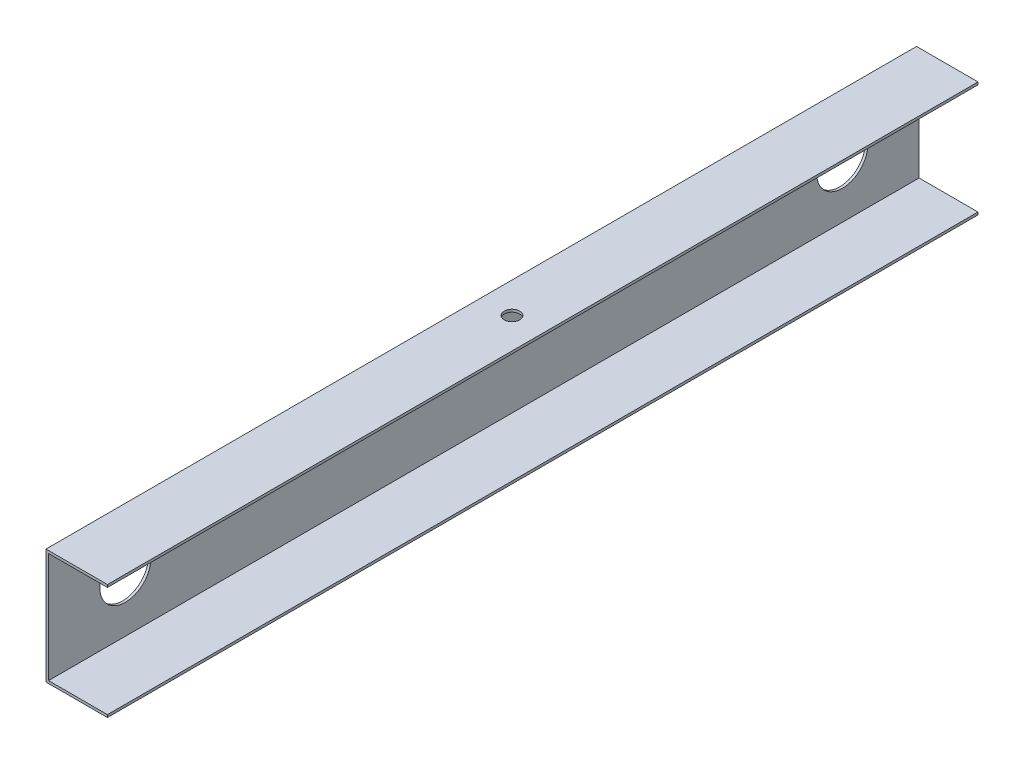
ISO-10303-21;
HEADER;
FILE_DESCRIPTION(('STEP AP214'),'2;1');
FILE_NAME('part.step','',(''),(''),'','','');
FILE_SCHEMA(('AUTOMOTIVE_DESIGN { 1 0 10303 214 1 1 1 1 }'));
ENDSEC;
DATA;
#1=APPLICATION_CONTEXT('core data for automotive mechanical design processes');
#2=APPLICATION_PROTOCOL_DEFINITION('international standard','automotive_design',2000,#1);
#3=PRODUCT_CONTEXT('',#1,'mechanical');
#4=PRODUCT('Part','Part','',(#3));
#5=PRODUCT_RELATED_PRODUCT_CATEGORY('part','',(#4));
#6=PRODUCT_DEFINITION_FORMATION('','',#4);
#7=PRODUCT_DEFINITION_CONTEXT('part definition',#1,'design');
#8=PRODUCT_DEFINITION('design','',#6,#7);
#9=PRODUCT_DEFINITION_SHAPE('','',#8);
#10=(LENGTH_UNIT() NAMED_UNIT(*) SI_UNIT(.MILLI.,.METRE.));
#11=(NAMED_UNIT(*) PLANE_ANGLE_UNIT() SI_UNIT($,.RADIAN.));
#12=(NAMED_UNIT(*) SI_UNIT($,.STERADIAN.) SOLID_ANGLE_UNIT());
#13=UNCERTAINTY_MEASURE_WITH_UNIT(LENGTH_MEASURE(1.E-05),#10,'distance_accuracy_value','');
#14=(GEOMETRIC_REPRESENTATION_CONTEXT(3) GLOBAL_UNCERTAINTY_ASSIGNED_CONTEXT((#13)) GLOBAL_UNIT_ASSIGNED_CONTEXT((#10,
#11,#12)) REPRESENTATION_CONTEXT('',''));
#15=CARTESIAN_POINT('',(0.,0.,0.));
#16=DIRECTION('',(0.,0.,1.));
#17=DIRECTION('',(1.,0.,0.));
#18=AXIS2_PLACEMENT_3D('',#15,#16,#17);
#19=CARTESIAN_POINT('',(0.,0.,340.));
#20=DIRECTION('',(1.,0.,0.));
#21=DIRECTION('',(0.,1.,0.));
#22=AXIS2_PLACEMENT_3D('',#19,#20,#21);
#23=PLANE('',#22);
#24=CARTESIAN_POINT('',(0.,-22.5,30.));
#25=DIRECTION('',(-1.,0.,0.));
#26=DIRECTION('',(0.,-1.,0.));
#27=AXIS2_PLACEMENT_3D('',#24,#25,#26);
#28=CIRCLE('',#27,10.);
#29=CARTESIAN_POINT('',(0.,-32.5,30.));
#30=VERTEX_POINT('',#29);
#31=EDGE_CURVE('E161',#30,#30,#28,.T.);
#32=ORIENTED_EDGE('',*,*,#31,.F.);
#33=EDGE_LOOP('',(#32));
#34=FACE_BOUND('',#33,.T.);
#35=CARTESIAN_POINT('',(0.,-22.5,310.));
#36=DIRECTION('',(-1.,0.,0.));
#37=DIRECTION('',(0.,1.,0.));
#38=AXIS2_PLACEMENT_3D('',#35,#36,#37);
#39=CIRCLE('',#38,10.);
#40=CARTESIAN_POINT('',(0.,-12.5,310.));
#41=VERTEX_POINT('',#40);
#42=EDGE_CURVE('E166',#41,#41,#39,.T.);
#43=ORIENTED_EDGE('',*,*,#42,.F.);
#44=EDGE_LOOP('',(#43));
#45=FACE_BOUND('',#44,.T.);
#46=DIRECTION('',(0.,-1.,0.));
#47=VECTOR('',#46,1.);
#48=CARTESIAN_POINT('',(0.,0.,0.));
#49=LINE('',#48,#47);
#50=CARTESIAN_POINT('',(0.,0.,0.));
#51=VERTEX_POINT('',#50);
#52=CARTESIAN_POINT('',(0.,-45.,0.));
#53=VERTEX_POINT('',#52);
#54=EDGE_CURVE('E134',#51,#53,#49,.T.);
#55=ORIENTED_EDGE('',*,*,#54,.T.);
#56=DIRECTION('',(0.,0.,-1.));
#57=VECTOR('',#56,1.);
#58=CARTESIAN_POINT('',(0.,-45.,340.));
#59=LINE('',#58,#57);
#60=CARTESIAN_POINT('',(0.,-45.,340.));
#61=VERTEX_POINT('',#60);
#62=EDGE_CURVE('E11',#61,#53,#59,.T.);
#63=ORIENTED_EDGE('',*,*,#62,.F.);
#64=DIRECTION('',(0.,-1.,0.));
#65=VECTOR('',#64,1.);
#66=CARTESIAN_POINT('',(0.,0.,340.));
#67=LINE('',#66,#65);
#68=CARTESIAN_POINT('',(0.,0.,340.));
#69=VERTEX_POINT('',#68);
#70=EDGE_CURVE('E148',#69,#61,#67,.T.);
#71=ORIENTED_EDGE('',*,*,#70,.F.);
#72=DIRECTION('',(0.,0.,-1.));
#73=VECTOR('',#72,1.);
#74=CARTESIAN_POINT('',(0.,0.,340.));
#75=LINE('',#74,#73);
#76=EDGE_CURVE('E130',#69,#51,#75,.T.);
#77=ORIENTED_EDGE('',*,*,#76,.T.);
#78=EDGE_LOOP('',(#55,#63,#71,#77));
#79=FACE_BOUND('',#78,.T.);
#80=ADVANCED_FACE('F36',(#34,#45,#79),#23,.F.);
#81=CARTESIAN_POINT('',(0.,-45.,340.));
#82=DIRECTION('',(0.,1.,0.));
#83=DIRECTION('',(0.,0.,1.));
#84=AXIS2_PLACEMENT_3D('',#81,#82,#83);
#85=PLANE('',#84);
#86=DIRECTION('',(1.,0.,0.));
#87=VECTOR('',#86,1.);
#88=CARTESIAN_POINT('',(0.,-45.,0.));
#89=LINE('',#88,#87);
#90=CARTESIAN_POINT('',(24.,-45.,0.));
#91=VERTEX_POINT('',#90);
#92=EDGE_CURVE('E137',#53,#91,#89,.T.);
#93=ORIENTED_EDGE('',*,*,#92,.T.);
#94=DIRECTION('',(0.,0.,-1.));
#95=VECTOR('',#94,1.);
#96=CARTESIAN_POINT('',(24.,-45.,340.));
#97=LINE('',#96,#95);
#98=CARTESIAN_POINT('',(24.,-45.,340.));
#99=VERTEX_POINT('',#98);
#100=EDGE_CURVE('E45',#99,#91,#97,.T.);
#101=ORIENTED_EDGE('',*,*,#100,.F.);
#102=DIRECTION('',(1.,0.,0.));
#103=VECTOR('',#102,1.);
#104=CARTESIAN_POINT('',(0.,-45.,340.));
#105=LINE('',#104,#103);
#106=EDGE_CURVE('E97',#61,#99,#105,.T.);
#107=ORIENTED_EDGE('',*,*,#106,.F.);
#108=ORIENTED_EDGE('',*,*,#62,.T.);
#109=EDGE_LOOP('',(#93,#101,#107,#108));
#110=FACE_BOUND('',#109,.T.);
#111=ADVANCED_FACE('F211',(#110),#85,.F.);
#112=CARTESIAN_POINT('',(24.,-44.,340.));
#113=DIRECTION('',(-1.,0.,0.));
#114=DIRECTION('',(0.,0.,1.));
#115=AXIS2_PLACEMENT_3D('',#112,#113,#114);
#116=PLANE('',#115);
#117=DIRECTION('',(0.,1.,0.));
#118=VECTOR('',#117,1.);
#119=CARTESIAN_POINT('',(24.,-44.,0.));
#120=LINE('',#119,#118);
#121=CARTESIAN_POINT('',(24.,-44.,0.));
#122=VERTEX_POINT('',#121);
#123=EDGE_CURVE('E139',#91,#122,#120,.T.);
#124=ORIENTED_EDGE('',*,*,#123,.T.);
#125=DIRECTION('',(0.,0.,-1.));
#126=VECTOR('',#125,1.);
#127=CARTESIAN_POINT('',(24.,-44.,340.));
#128=LINE('',#127,#126);
#129=CARTESIAN_POINT('',(24.,-44.,340.));
#130=VERTEX_POINT('',#129);
#131=EDGE_CURVE('E155',#130,#122,#128,.T.);
#132=ORIENTED_EDGE('',*,*,#131,.F.);
#133=DIRECTION('',(0.,1.,0.));
#134=VECTOR('',#133,1.);
#135=CARTESIAN_POINT('',(24.,-44.,340.));
#136=LINE('',#135,#134);
#137=EDGE_CURVE('E178',#99,#130,#136,.T.);
#138=ORIENTED_EDGE('',*,*,#137,.F.);
#139=ORIENTED_EDGE('',*,*,#100,.T.);
#140=EDGE_LOOP('',(#124,#132,#138,#139));
#141=FACE_BOUND('',#140,.T.);
#142=ADVANCED_FACE('F216',(#141),#116,.F.);
#143=CARTESIAN_POINT('',(1.,-44.,340.));
#144=DIRECTION('',(0.,-1.,0.));
#145=DIRECTION('',(0.,0.,-1.));
#146=AXIS2_PLACEMENT_3D('',#143,#144,#145);
#147=PLANE('',#146);
#148=DIRECTION('',(-1.,0.,0.));
#149=VECTOR('',#148,1.);
#150=CARTESIAN_POINT('',(1.,-44.,0.));
#151=LINE('',#150,#149);
#152=CARTESIAN_POINT('',(1.,-44.,0.));
#153=VERTEX_POINT('',#152);
#154=EDGE_CURVE('E141',#122,#153,#151,.T.);
#155=ORIENTED_EDGE('',*,*,#154,.T.);
#156=DIRECTION('',(0.,0.,-1.));
#157=VECTOR('',#156,1.);
#158=CARTESIAN_POINT('',(1.,-44.,340.));
#159=LINE('',#158,#157);
#160=CARTESIAN_POINT('',(1.,-44.,340.));
#161=VERTEX_POINT('',#160);
#162=EDGE_CURVE('E152',#161,#153,#159,.T.);
#163=ORIENTED_EDGE('',*,*,#162,.F.);
#164=DIRECTION('',(-1.,0.,0.));
#165=VECTOR('',#164,1.);
#166=CARTESIAN_POINT('',(1.,-44.,340.));
#167=LINE('',#166,#165);
#168=EDGE_CURVE('E180',#130,#161,#167,.T.);
#169=ORIENTED_EDGE('',*,*,#168,.F.);
#170=ORIENTED_EDGE('',*,*,#131,.T.);
#171=EDGE_LOOP('',(#155,#163,#169,#170));
#172=FACE_BOUND('',#171,.T.);
#173=ADVANCED_FACE('F186',(#172),#147,.F.);
#174=CARTESIAN_POINT('',(1.,-1.,340.));
#175=DIRECTION('',(-1.,0.,0.));
#176=DIRECTION('',(0.,0.,1.));
#177=AXIS2_PLACEMENT_3D('',#174,#175,#176);
#178=PLANE('',#177);
#179=CARTESIAN_POINT('',(1.,-22.5,30.));
#180=DIRECTION('',(-1.,0.,0.));
#181=DIRECTION('',(0.,0.,1.));
#182=AXIS2_PLACEMENT_3D('',#179,#180,#181);
#183=CIRCLE('',#182,10.);
#184=CARTESIAN_POINT('',(1.,-22.5,40.));
#185=VERTEX_POINT('',#184);
#186=EDGE_CURVE('E39',#185,#185,#183,.T.);
#187=ORIENTED_EDGE('',*,*,#186,.T.);
#188=EDGE_LOOP('',(#187));
#189=FACE_BOUND('',#188,.T.);
#190=CARTESIAN_POINT('',(1.,-22.5,310.));
#191=DIRECTION('',(-1.,0.,0.));
#192=DIRECTION('',(0.,0.,1.));
#193=AXIS2_PLACEMENT_3D('',#190,#191,#192);
#194=CIRCLE('',#193,10.);
#195=CARTESIAN_POINT('',(1.,-22.5,320.));
#196=VERTEX_POINT('',#195);
#197=EDGE_CURVE('E159',#196,#196,#194,.T.);
#198=ORIENTED_EDGE('',*,*,#197,.T.);
#199=EDGE_LOOP('',(#198));
#200=FACE_BOUND('',#199,.T.);
#201=DIRECTION('',(0.,1.,0.));
#202=VECTOR('',#201,1.);
#203=CARTESIAN_POINT('',(1.,-1.,0.));
#204=LINE('',#203,#202);
#205=CARTESIAN_POINT('',(1.,-1.,0.));
#206=VERTEX_POINT('',#205);
#207=EDGE_CURVE('E143',#153,#206,#204,.T.);
#208=ORIENTED_EDGE('',*,*,#207,.T.);
#209=DIRECTION('',(0.,0.,-1.));
#210=VECTOR('',#209,1.);
#211=CARTESIAN_POINT('',(1.,-1.,340.));
#212=LINE('',#211,#210);
#213=CARTESIAN_POINT('',(1.,-1.,340.));
#214=VERTEX_POINT('',#213);
#215=EDGE_CURVE('E125',#214,#206,#212,.T.);
#216=ORIENTED_EDGE('',*,*,#215,.F.);
#217=DIRECTION('',(0.,1.,0.));
#218=VECTOR('',#217,1.);
#219=CARTESIAN_POINT('',(1.,-1.,340.));
#220=LINE('',#219,#218);
#221=EDGE_CURVE('E116',#161,#214,#220,.T.);
#222=ORIENTED_EDGE('',*,*,#221,.F.);
#223=ORIENTED_EDGE('',*,*,#162,.T.);
#224=EDGE_LOOP('',(#208,#216,#222,#223));
#225=FACE_BOUND('',#224,.T.);
#226=ADVANCED_FACE('F190',(#189,#200,#225),#178,.F.);
#227=CARTESIAN_POINT('',(1.,-1.,340.));
#228=DIRECTION('',(0.,1.,0.));
#229=DIRECTION('',(0.,0.,1.));
#230=AXIS2_PLACEMENT_3D('',#227,#228,#229);
#231=PLANE('',#230);
#232=CARTESIAN_POINT('',(12.,-1.,170.));
#233=DIRECTION('',(0.,1.,0.));
#234=DIRECTION('',(0.,0.,1.));
#235=AXIS2_PLACEMENT_3D('',#232,#233,#234);
#236=CIRCLE('',#235,3.);
#237=CARTESIAN_POINT('',(12.,-1.,173.));
#238=VERTEX_POINT('',#237);
#239=EDGE_CURVE('E171',#238,#238,#236,.T.);
#240=ORIENTED_EDGE('',*,*,#239,.T.);
#241=EDGE_LOOP('',(#240));
#242=FACE_BOUND('',#241,.T.);
#243=DIRECTION('',(1.,0.,0.));
#244=VECTOR('',#243,1.);
#245=CARTESIAN_POINT('',(1.,-1.,0.));
#246=LINE('',#245,#244);
#247=CARTESIAN_POINT('',(24.,-1.,0.));
#248=VERTEX_POINT('',#247);
#249=EDGE_CURVE('E124',#206,#248,#246,.T.);
#250=ORIENTED_EDGE('',*,*,#249,.T.);
#251=DIRECTION('',(0.,0.,-1.));
#252=VECTOR('',#251,1.);
#253=CARTESIAN_POINT('',(24.,-1.,340.));
#254=LINE('',#253,#252);
#255=CARTESIAN_POINT('',(24.,-1.,340.));
#256=VERTEX_POINT('',#255);
#257=EDGE_CURVE('E121',#256,#248,#254,.T.);
#258=ORIENTED_EDGE('',*,*,#257,.F.);
#259=DIRECTION('',(1.,0.,0.));
#260=VECTOR('',#259,1.);
#261=CARTESIAN_POINT('',(1.,-1.,340.));
#262=LINE('',#261,#260);
#263=EDGE_CURVE('E110',#214,#256,#262,.T.);
#264=ORIENTED_EDGE('',*,*,#263,.F.);
#265=ORIENTED_EDGE('',*,*,#215,.T.);
#266=EDGE_LOOP('',(#250,#258,#264,#265));
#267=FACE_BOUND('',#266,.T.);
#268=ADVANCED_FACE('F122',(#242,#267),#231,.F.);
#269=CARTESIAN_POINT('',(24.,0.,340.));
#270=DIRECTION('',(-1.,0.,0.));
#271=DIRECTION('',(0.,0.,1.));
#272=AXIS2_PLACEMENT_3D('',#269,#270,#271);
#273=PLANE('',#272);
#274=DIRECTION('',(0.,1.,0.));
#275=VECTOR('',#274,1.);
#276=CARTESIAN_POINT('',(24.,0.,0.));
#277=LINE('',#276,#275);
#278=CARTESIAN_POINT('',(24.,0.,0.));
#279=VERTEX_POINT('',#278);
#280=EDGE_CURVE('E83',#248,#279,#277,.T.);
#281=ORIENTED_EDGE('',*,*,#280,.T.);
#282=DIRECTION('',(0.,0.,-1.));
#283=VECTOR('',#282,1.);
#284=CARTESIAN_POINT('',(24.,0.,340.));
#285=LINE('',#284,#283);
#286=CARTESIAN_POINT('',(24.,0.,340.));
#287=VERTEX_POINT('',#286);
#288=EDGE_CURVE('E126',#287,#279,#285,.T.);
#289=ORIENTED_EDGE('',*,*,#288,.F.);
#290=DIRECTION('',(0.,1.,0.));
#291=VECTOR('',#290,1.);
#292=CARTESIAN_POINT('',(24.,0.,340.));
#293=LINE('',#292,#291);
#294=EDGE_CURVE('E114',#256,#287,#293,.T.);
#295=ORIENTED_EDGE('',*,*,#294,.F.);
#296=ORIENTED_EDGE('',*,*,#257,.T.);
#297=EDGE_LOOP('',(#281,#289,#295,#296));
#298=FACE_BOUND('',#297,.T.);
#299=ADVANCED_FACE('F128',(#298),#273,.F.);
#300=CARTESIAN_POINT('',(0.,0.,340.));
#301=DIRECTION('',(0.,-1.,0.));
#302=DIRECTION('',(0.,0.,-1.));
#303=AXIS2_PLACEMENT_3D('',#300,#301,#302);
#304=PLANE('',#303);
#305=CARTESIAN_POINT('',(12.,0.,170.));
#306=DIRECTION('',(0.,1.,0.));
#307=DIRECTION('',(0.,0.,1.));
#308=AXIS2_PLACEMENT_3D('',#305,#306,#307);
#309=CIRCLE('',#308,3.);
#310=CARTESIAN_POINT('',(12.,0.,173.));
#311=VERTEX_POINT('',#310);
#312=EDGE_CURVE('E238',#311,#311,#309,.T.);
#313=ORIENTED_EDGE('',*,*,#312,.F.);
#314=EDGE_LOOP('',(#313));
#315=FACE_BOUND('',#314,.T.);
#316=DIRECTION('',(-1.,0.,0.));
#317=VECTOR('',#316,1.);
#318=CARTESIAN_POINT('',(0.,0.,0.));
#319=LINE('',#318,#317);
#320=EDGE_CURVE('E89',#279,#51,#319,.T.);
#321=ORIENTED_EDGE('',*,*,#320,.T.);
#322=ORIENTED_EDGE('',*,*,#76,.F.);
#323=DIRECTION('',(-1.,0.,0.));
#324=VECTOR('',#323,1.);
#325=CARTESIAN_POINT('',(0.,0.,340.));
#326=LINE('',#325,#324);
#327=EDGE_CURVE('E54',#287,#69,#326,.T.);
#328=ORIENTED_EDGE('',*,*,#327,.F.);
#329=ORIENTED_EDGE('',*,*,#288,.T.);
#330=EDGE_LOOP('',(#321,#322,#328,#329));
#331=FACE_BOUND('',#330,.T.);
#332=ADVANCED_FACE('F198',(#315,#331),#304,.F.);
#333=CARTESIAN_POINT('',(0.,0.,340.));
#334=DIRECTION('',(0.,0.,1.));
#335=DIRECTION('',(1.,0.,0.));
#336=AXIS2_PLACEMENT_3D('',#333,#334,#335);
#337=PLANE('',#336);
#338=ORIENTED_EDGE('',*,*,#70,.T.);
#339=ORIENTED_EDGE('',*,*,#106,.T.);
#340=ORIENTED_EDGE('',*,*,#137,.T.);
#341=ORIENTED_EDGE('',*,*,#168,.T.);
#342=ORIENTED_EDGE('',*,*,#221,.T.);
#343=ORIENTED_EDGE('',*,*,#263,.T.);
#344=ORIENTED_EDGE('',*,*,#294,.T.);
#345=ORIENTED_EDGE('',*,*,#327,.T.);
#346=EDGE_LOOP('',(#338,#339,#340,#341,#342,#343,#344,#345));
#347=FACE_BOUND('',#346,.T.);
#348=ADVANCED_FACE('F112',(#347),#337,.T.);
#349=CARTESIAN_POINT('',(0.,0.,0.));
#350=DIRECTION('',(0.,0.,1.));
#351=DIRECTION('',(1.,0.,0.));
#352=AXIS2_PLACEMENT_3D('',#349,#350,#351);
#353=PLANE('',#352);
#354=ORIENTED_EDGE('',*,*,#54,.F.);
#355=ORIENTED_EDGE('',*,*,#320,.F.);
#356=ORIENTED_EDGE('',*,*,#280,.F.);
#357=ORIENTED_EDGE('',*,*,#249,.F.);
#358=ORIENTED_EDGE('',*,*,#207,.F.);
#359=ORIENTED_EDGE('',*,*,#154,.F.);
#360=ORIENTED_EDGE('',*,*,#123,.F.);
#361=ORIENTED_EDGE('',*,*,#92,.F.);
#362=EDGE_LOOP('',(#354,#355,#356,#357,#358,#359,#360,#361));
#363=FACE_BOUND('',#362,.T.);
#364=ADVANCED_FACE('F193',(#363),#353,.F.);
#365=CARTESIAN_POINT('',(340.,-22.4999999999999,310.));
#366=DIRECTION('',(-1.,0.,0.));
#367=DIRECTION('',(0.,-1.,0.));
#368=AXIS2_PLACEMENT_3D('',#365,#366,#367);
#369=CYLINDRICAL_SURFACE('',#368,10.);
#370=ORIENTED_EDGE('',*,*,#42,.T.);
#371=EDGE_LOOP('',(#370));
#372=FACE_BOUND('',#371,.T.);
#373=ORIENTED_EDGE('',*,*,#197,.F.);
#374=EDGE_LOOP('',(#373));
#375=FACE_BOUND('',#374,.T.);
#376=ADVANCED_FACE('F220',(#372,#375),#369,.F.);
#377=CARTESIAN_POINT('',(340.,-22.5,30.));
#378=DIRECTION('',(-1.,0.,0.));
#379=DIRECTION('',(0.,-1.,0.));
#380=AXIS2_PLACEMENT_3D('',#377,#378,#379);
#381=CYLINDRICAL_SURFACE('',#380,10.);
#382=ORIENTED_EDGE('',*,*,#31,.T.);
#383=EDGE_LOOP('',(#382));
#384=FACE_BOUND('',#383,.T.);
#385=ORIENTED_EDGE('',*,*,#186,.F.);
#386=EDGE_LOOP('',(#385));
#387=FACE_BOUND('',#386,.T.);
#388=ADVANCED_FACE('F223',(#384,#387),#381,.F.);
#389=CARTESIAN_POINT('',(12.,-24.9999999999999,170.));
#390=DIRECTION('',(0.,1.,0.));
#391=DIRECTION('',(0.,0.,1.));
#392=AXIS2_PLACEMENT_3D('',#389,#390,#391);
#393=CYLINDRICAL_SURFACE('',#392,3.);
#394=ORIENTED_EDGE('',*,*,#312,.T.);
#395=EDGE_LOOP('',(#394));
#396=FACE_BOUND('',#395,.T.);
#397=ORIENTED_EDGE('',*,*,#239,.F.);
#398=EDGE_LOOP('',(#397));
#399=FACE_BOUND('',#398,.T.);
#400=ADVANCED_FACE('F229',(#396,#399),#393,.F.);
#401=CLOSED_SHELL('',(#80,#111,#142,#173,#226,#268,#299,#332,#348,#364,#376,#388,#400));
#402=MANIFOLD_SOLID_BREP('B2',#401);
#403=ADVANCED_BREP_SHAPE_REPRESENTATION('',(#18,#402),#14);
#404=SHAPE_DEFINITION_REPRESENTATION(#9,#403);
ENDSEC;
END-ISO-10303-21;
